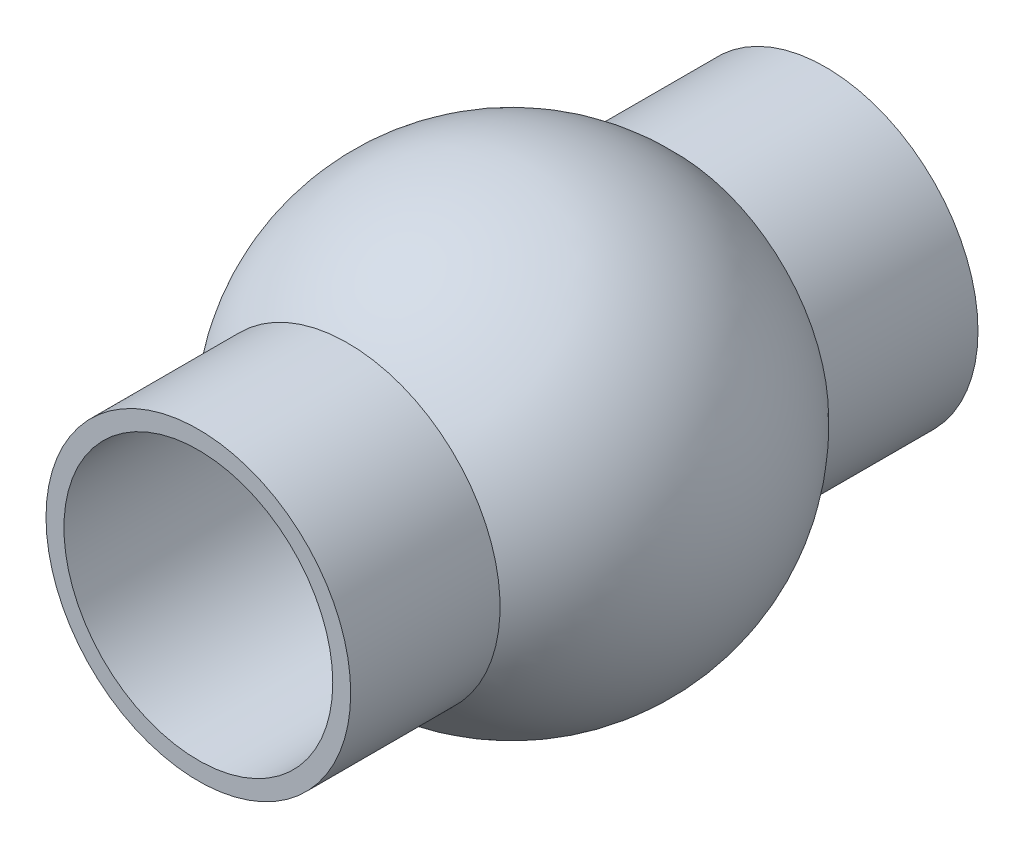
ISO-10303-21;
HEADER;
FILE_DESCRIPTION(('STEP AP214'),'2;1');
FILE_NAME('part.step','',(''),(''),'','','');
FILE_SCHEMA(('AUTOMOTIVE_DESIGN { 1 0 10303 214 1 1 1 1 }'));
ENDSEC;
DATA;
#1=APPLICATION_CONTEXT('core data for automotive mechanical design processes');
#2=APPLICATION_PROTOCOL_DEFINITION('international standard','automotive_design',2000,#1);
#3=PRODUCT_CONTEXT('',#1,'mechanical');
#4=PRODUCT('Part','Part','',(#3));
#5=PRODUCT_RELATED_PRODUCT_CATEGORY('part','',(#4));
#6=PRODUCT_DEFINITION_FORMATION('','',#4);
#7=PRODUCT_DEFINITION_CONTEXT('part definition',#1,'design');
#8=PRODUCT_DEFINITION('design','',#6,#7);
#9=PRODUCT_DEFINITION_SHAPE('','',#8);
#10=(LENGTH_UNIT() NAMED_UNIT(*) SI_UNIT(.MILLI.,.METRE.));
#11=(NAMED_UNIT(*) PLANE_ANGLE_UNIT() SI_UNIT($,.RADIAN.));
#12=(NAMED_UNIT(*) SI_UNIT($,.STERADIAN.) SOLID_ANGLE_UNIT());
#13=UNCERTAINTY_MEASURE_WITH_UNIT(LENGTH_MEASURE(1.E-05),#10,'distance_accuracy_value','');
#14=(GEOMETRIC_REPRESENTATION_CONTEXT(3) GLOBAL_UNCERTAINTY_ASSIGNED_CONTEXT((#13)) GLOBAL_UNIT_ASSIGNED_CONTEXT((#10,
#11,#12)) REPRESENTATION_CONTEXT('',''));
#15=CARTESIAN_POINT('',(0.,0.,0.));
#16=DIRECTION('',(0.,0.,1.));
#17=DIRECTION('',(1.,0.,0.));
#18=AXIS2_PLACEMENT_3D('',#15,#16,#17);
#19=CARTESIAN_POINT('',(0.,0.,0.));
#20=DIRECTION('',(0.,1.,0.));
#21=DIRECTION('',(1.,0.,0.));
#22=AXIS2_PLACEMENT_3D('',#19,#20,#21);
#23=SPHERICAL_SURFACE('',#22,2.5);
#24=CARTESIAN_POINT('',(0.,0.,0.));
#25=DIRECTION('',(0.,0.,-1.));
#26=DIRECTION('',(-1.,0.,0.));
#27=AXIS2_PLACEMENT_3D('',#24,#25,#26);
#28=SPHERICAL_SURFACE('',#27,2.5);
#29=CARTESIAN_POINT('',(0.,0.,1.83303027798234));
#30=DIRECTION('',(0.,0.,-1.));
#31=DIRECTION('',(-1.,0.,0.));
#32=AXIS2_PLACEMENT_3D('',#29,#30,#31);
#33=CIRCLE('',#32,1.7);
#34=CARTESIAN_POINT('',(-1.7,0.,1.83303027798234));
#35=VERTEX_POINT('',#34);
#36=EDGE_CURVE('E40',#35,#35,#33,.F.);
#37=ORIENTED_EDGE('',*,*,#36,.F.);
#38=EDGE_LOOP('',(#37));
#39=FACE_BOUND('',#38,.T.);
#40=CARTESIAN_POINT('',(0.,0.,-1.83303027798234));
#41=DIRECTION('',(0.,0.,1.));
#42=DIRECTION('',(1.,0.,0.));
#43=AXIS2_PLACEMENT_3D('',#40,#41,#42);
#44=CIRCLE('',#43,1.7);
#45=CARTESIAN_POINT('',(1.7,0.,-1.83303027798234));
#46=VERTEX_POINT('',#45);
#47=EDGE_CURVE('E10',#46,#46,#44,.F.);
#48=ORIENTED_EDGE('',*,*,#47,.F.);
#49=EDGE_LOOP('',(#48));
#50=FACE_BOUND('',#49,.T.);
#51=ADVANCED_FACE('F34',(#39,#50),#28,.T.);
#52=CARTESIAN_POINT('',(0.,0.,3.5));
#53=DIRECTION('',(0.,0.,-1.));
#54=DIRECTION('',(-1.,0.,0.));
#55=AXIS2_PLACEMENT_3D('',#52,#53,#54);
#56=CYLINDRICAL_SURFACE('',#55,1.7);
#57=CARTESIAN_POINT('',(0.,0.,3.5));
#58=DIRECTION('',(0.,0.,1.));
#59=DIRECTION('',(1.,0.,0.));
#60=AXIS2_PLACEMENT_3D('',#57,#58,#59);
#61=CIRCLE('',#60,1.7);
#62=CARTESIAN_POINT('',(1.7,0.,3.5));
#63=VERTEX_POINT('',#62);
#64=EDGE_CURVE('E44',#63,#63,#61,.T.);
#65=ORIENTED_EDGE('',*,*,#64,.F.);
#66=EDGE_LOOP('',(#65));
#67=FACE_BOUND('',#66,.T.);
#68=ORIENTED_EDGE('',*,*,#36,.T.);
#69=EDGE_LOOP('',(#68));
#70=FACE_BOUND('',#69,.T.);
#71=ADVANCED_FACE('F65',(#67,#70),#56,.T.);
#72=CARTESIAN_POINT('',(0.,0.,3.5));
#73=DIRECTION('',(0.,0.,1.));
#74=DIRECTION('',(1.,0.,0.));
#75=AXIS2_PLACEMENT_3D('',#72,#73,#74);
#76=PLANE('',#75);
#77=ORIENTED_EDGE('',*,*,#64,.T.);
#78=EDGE_LOOP('',(#77));
#79=FACE_BOUND('',#78,.T.);
#80=CARTESIAN_POINT('',(0.,0.,3.5));
#81=DIRECTION('',(0.,0.,1.));
#82=DIRECTION('',(1.,0.,0.));
#83=AXIS2_PLACEMENT_3D('',#80,#81,#82);
#84=CIRCLE('',#83,1.5);
#85=CARTESIAN_POINT('',(1.5,0.,3.5));
#86=VERTEX_POINT('',#85);
#87=EDGE_CURVE('E52',#86,#86,#84,.T.);
#88=ORIENTED_EDGE('',*,*,#87,.F.);
#89=EDGE_LOOP('',(#88));
#90=FACE_BOUND('',#89,.T.);
#91=ADVANCED_FACE('F63',(#79,#90),#76,.T.);
#92=CARTESIAN_POINT('',(0.,0.,-2.5));
#93=DIRECTION('',(0.,0.,1.));
#94=DIRECTION('',(1.,0.,0.));
#95=AXIS2_PLACEMENT_3D('',#92,#93,#94);
#96=CYLINDRICAL_SURFACE('',#95,1.5);
#97=ORIENTED_EDGE('',*,*,#87,.T.);
#98=EDGE_LOOP('',(#97));
#99=FACE_BOUND('',#98,.T.);
#100=CARTESIAN_POINT('',(0.,0.,-3.5));
#101=DIRECTION('',(0.,0.,1.));
#102=DIRECTION('',(1.,0.,0.));
#103=AXIS2_PLACEMENT_3D('',#100,#101,#102);
#104=CIRCLE('',#103,1.5);
#105=CARTESIAN_POINT('',(1.5,0.,-3.5));
#106=VERTEX_POINT('',#105);
#107=EDGE_CURVE('E54',#106,#106,#104,.T.);
#108=ORIENTED_EDGE('',*,*,#107,.F.);
#109=EDGE_LOOP('',(#108));
#110=FACE_BOUND('',#109,.T.);
#111=ADVANCED_FACE('F60',(#99,#110),#96,.F.);
#112=CARTESIAN_POINT('',(0.,0.,-3.5));
#113=DIRECTION('',(0.,0.,1.));
#114=DIRECTION('',(1.,0.,0.));
#115=AXIS2_PLACEMENT_3D('',#112,#113,#114);
#116=CIRCLE('',#115,1.7);
#117=CARTESIAN_POINT('',(1.7,0.,-3.5));
#118=VERTEX_POINT('',#117);
#119=EDGE_CURVE('E48',#118,#118,#116,.T.);
#120=ORIENTED_EDGE('',*,*,#119,.T.);
#121=EDGE_LOOP('',(#120));
#122=FACE_BOUND('',#121,.T.);
#123=ORIENTED_EDGE('',*,*,#47,.T.);
#124=EDGE_LOOP('',(#123));
#125=FACE_BOUND('',#124,.T.);
#126=ADVANCED_FACE('F72',(#122,#125),#56,.T.);
#127=CARTESIAN_POINT('',(0.,0.,-3.5));
#128=DIRECTION('',(0.,0.,1.));
#129=DIRECTION('',(1.,0.,0.));
#130=AXIS2_PLACEMENT_3D('',#127,#128,#129);
#131=PLANE('',#130);
#132=ORIENTED_EDGE('',*,*,#119,.F.);
#133=EDGE_LOOP('',(#132));
#134=FACE_BOUND('',#133,.T.);
#135=ORIENTED_EDGE('',*,*,#107,.T.);
#136=EDGE_LOOP('',(#135));
#137=FACE_BOUND('',#136,.T.);
#138=ADVANCED_FACE('F105',(#134,#137),#131,.F.);
#139=CLOSED_SHELL('',(#51,#71,#91,#111,#126,#138));
#140=MANIFOLD_SOLID_BREP('B2',#139);
#141=ADVANCED_BREP_SHAPE_REPRESENTATION('',(#18,#140),#14);
#142=SHAPE_DEFINITION_REPRESENTATION(#9,#141);
ENDSEC;
END-ISO-10303-21;
